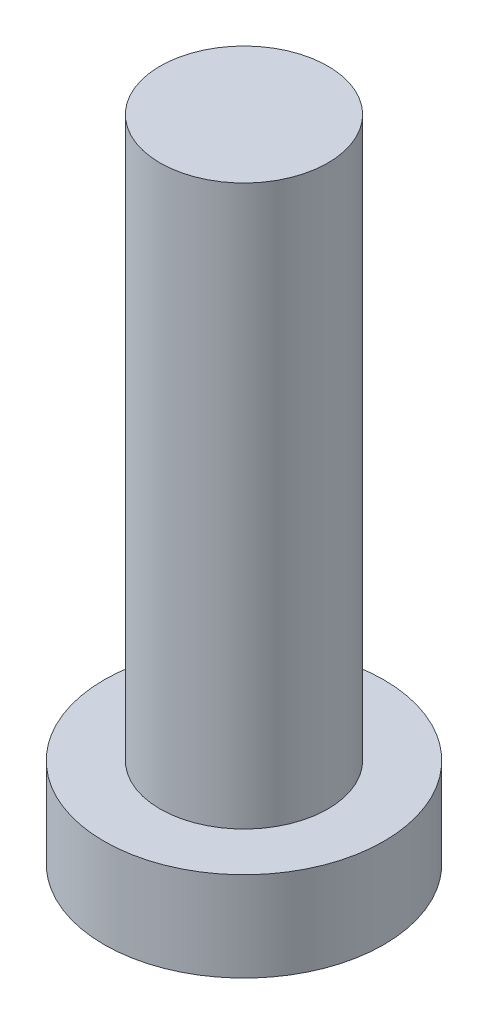
ISO-10303-21;
HEADER;
FILE_DESCRIPTION(('STEP AP214'),'2;1');
FILE_NAME('part.step','',(''),(''),'','','');
FILE_SCHEMA(('AUTOMOTIVE_DESIGN { 1 0 10303 214 1 1 1 1 }'));
ENDSEC;
DATA;
#1=APPLICATION_CONTEXT('core data for automotive mechanical design processes');
#2=APPLICATION_PROTOCOL_DEFINITION('international standard','automotive_design',2000,#1);
#3=PRODUCT_CONTEXT('',#1,'mechanical');
#4=PRODUCT('Part','Part','',(#3));
#5=PRODUCT_RELATED_PRODUCT_CATEGORY('part','',(#4));
#6=PRODUCT_DEFINITION_FORMATION('','',#4);
#7=PRODUCT_DEFINITION_CONTEXT('part definition',#1,'design');
#8=PRODUCT_DEFINITION('design','',#6,#7);
#9=PRODUCT_DEFINITION_SHAPE('','',#8);
#10=(LENGTH_UNIT() NAMED_UNIT(*) SI_UNIT(.MILLI.,.METRE.));
#11=(NAMED_UNIT(*) PLANE_ANGLE_UNIT() SI_UNIT($,.RADIAN.));
#12=(NAMED_UNIT(*) SI_UNIT($,.STERADIAN.) SOLID_ANGLE_UNIT());
#13=UNCERTAINTY_MEASURE_WITH_UNIT(LENGTH_MEASURE(1.E-05),#10,'distance_accuracy_value','');
#14=(GEOMETRIC_REPRESENTATION_CONTEXT(3) GLOBAL_UNCERTAINTY_ASSIGNED_CONTEXT((#13)) GLOBAL_UNIT_ASSIGNED_CONTEXT((#10,
#11,#12)) REPRESENTATION_CONTEXT('',''));
#15=CARTESIAN_POINT('',(0.,0.,0.));
#16=DIRECTION('',(0.,0.,1.));
#17=DIRECTION('',(1.,0.,0.));
#18=AXIS2_PLACEMENT_3D('',#15,#16,#17);
#19=CARTESIAN_POINT('',(0.,0.,0.));
#20=DIRECTION('',(0.,1.,0.));
#21=DIRECTION('',(0.,0.,1.));
#22=AXIS2_PLACEMENT_3D('',#19,#20,#21);
#23=PLANE('',#22);
#24=CARTESIAN_POINT('',(0.,0.,0.));
#25=DIRECTION('',(0.,1.,0.));
#26=DIRECTION('',(0.,0.,1.));
#27=AXIS2_PLACEMENT_3D('',#24,#25,#26);
#28=CIRCLE('',#27,2.5);
#29=CARTESIAN_POINT('',(0.,0.,2.5));
#30=VERTEX_POINT('',#29);
#31=EDGE_CURVE('E39',#30,#30,#28,.T.);
#32=ORIENTED_EDGE('',*,*,#31,.F.);
#33=EDGE_LOOP('',(#32));
#34=FACE_BOUND('',#33,.T.);
#35=CARTESIAN_POINT('',(1.,0.,1.));
#36=DIRECTION('',(0.,1.,0.));
#37=DIRECTION('',(0.,0.,-1.));
#38=AXIS2_PLACEMENT_3D('',#35,#36,#37);
#39=CIRCLE('',#38,0.5);
#40=CARTESIAN_POINT('',(1.,0.,0.5));
#41=VERTEX_POINT('',#40);
#42=CARTESIAN_POINT('',(0.5,0.,1.));
#43=VERTEX_POINT('',#42);
#44=EDGE_CURVE('E186',#41,#43,#39,.T.);
#45=ORIENTED_EDGE('',*,*,#44,.F.);
#46=DIRECTION('',(-1.,0.,0.));
#47=VECTOR('',#46,1.);
#48=CARTESIAN_POINT('',(1.,0.,0.5));
#49=LINE('',#48,#47);
#50=CARTESIAN_POINT('',(1.75,0.,0.5));
#51=VERTEX_POINT('',#50);
#52=EDGE_CURVE('E52',#51,#41,#49,.T.);
#53=ORIENTED_EDGE('',*,*,#52,.F.);
#54=DIRECTION('',(0.,0.,1.));
#55=VECTOR('',#54,1.);
#56=CARTESIAN_POINT('',(1.75,0.,-0.5));
#57=LINE('',#56,#55);
#58=CARTESIAN_POINT('',(1.75,0.,-0.5));
#59=VERTEX_POINT('',#58);
#60=EDGE_CURVE('E225',#59,#51,#57,.T.);
#61=ORIENTED_EDGE('',*,*,#60,.F.);
#62=DIRECTION('',(1.,0.,0.));
#63=VECTOR('',#62,1.);
#64=CARTESIAN_POINT('',(1.,0.,-0.5));
#65=LINE('',#64,#63);
#66=CARTESIAN_POINT('',(1.,0.,-0.5));
#67=VERTEX_POINT('',#66);
#68=EDGE_CURVE('E223',#67,#59,#65,.T.);
#69=ORIENTED_EDGE('',*,*,#68,.F.);
#70=CARTESIAN_POINT('',(1.,0.,-1.));
#71=DIRECTION('',(0.,1.,0.));
#72=DIRECTION('',(0.,0.,-1.));
#73=AXIS2_PLACEMENT_3D('',#70,#71,#72);
#74=CIRCLE('',#73,0.5);
#75=CARTESIAN_POINT('',(0.5,0.,-1.));
#76=VERTEX_POINT('',#75);
#77=EDGE_CURVE('E160',#76,#67,#74,.T.);
#78=ORIENTED_EDGE('',*,*,#77,.F.);
#79=DIRECTION('',(0.,0.,1.));
#80=VECTOR('',#79,1.);
#81=CARTESIAN_POINT('',(0.5,0.,-1.75));
#82=LINE('',#81,#80);
#83=CARTESIAN_POINT('',(0.5,0.,-1.75));
#84=VERTEX_POINT('',#83);
#85=EDGE_CURVE('E219',#84,#76,#82,.T.);
#86=ORIENTED_EDGE('',*,*,#85,.F.);
#87=DIRECTION('',(1.,0.,0.));
#88=VECTOR('',#87,1.);
#89=CARTESIAN_POINT('',(-0.5,0.,-1.75));
#90=LINE('',#89,#88);
#91=CARTESIAN_POINT('',(-0.5,0.,-1.75));
#92=VERTEX_POINT('',#91);
#93=EDGE_CURVE('E216',#92,#84,#90,.T.);
#94=ORIENTED_EDGE('',*,*,#93,.F.);
#95=DIRECTION('',(0.,0.,-1.));
#96=VECTOR('',#95,1.);
#97=CARTESIAN_POINT('',(-0.5,0.,-1.75));
#98=LINE('',#97,#96);
#99=CARTESIAN_POINT('',(-0.5,0.,-1.));
#100=VERTEX_POINT('',#99);
#101=EDGE_CURVE('E213',#100,#92,#98,.T.);
#102=ORIENTED_EDGE('',*,*,#101,.F.);
#103=CARTESIAN_POINT('',(-1.,0.,-1.));
#104=DIRECTION('',(0.,1.,0.));
#105=DIRECTION('',(0.,0.,-1.));
#106=AXIS2_PLACEMENT_3D('',#103,#104,#105);
#107=CIRCLE('',#106,0.5);
#108=CARTESIAN_POINT('',(-1.,0.,-0.5));
#109=VERTEX_POINT('',#108);
#110=EDGE_CURVE('E210',#109,#100,#107,.T.);
#111=ORIENTED_EDGE('',*,*,#110,.F.);
#112=DIRECTION('',(1.,0.,0.));
#113=VECTOR('',#112,1.);
#114=CARTESIAN_POINT('',(-1.75,0.,-0.5));
#115=LINE('',#114,#113);
#116=CARTESIAN_POINT('',(-1.75,0.,-0.5));
#117=VERTEX_POINT('',#116);
#118=EDGE_CURVE('E207',#117,#109,#115,.T.);
#119=ORIENTED_EDGE('',*,*,#118,.F.);
#120=DIRECTION('',(0.,0.,-1.));
#121=VECTOR('',#120,1.);
#122=CARTESIAN_POINT('',(-1.75,0.,-0.5));
#123=LINE('',#122,#121);
#124=CARTESIAN_POINT('',(-1.75,0.,0.5));
#125=VERTEX_POINT('',#124);
#126=EDGE_CURVE('E204',#125,#117,#123,.T.);
#127=ORIENTED_EDGE('',*,*,#126,.F.);
#128=DIRECTION('',(-1.,0.,0.));
#129=VECTOR('',#128,1.);
#130=CARTESIAN_POINT('',(-1.75,0.,0.5));
#131=LINE('',#130,#129);
#132=CARTESIAN_POINT('',(-1.,0.,0.5));
#133=VERTEX_POINT('',#132);
#134=EDGE_CURVE('E201',#133,#125,#131,.T.);
#135=ORIENTED_EDGE('',*,*,#134,.F.);
#136=CARTESIAN_POINT('',(-1.,0.,1.));
#137=DIRECTION('',(0.,1.,0.));
#138=DIRECTION('',(0.,0.,1.));
#139=AXIS2_PLACEMENT_3D('',#136,#137,#138);
#140=CIRCLE('',#139,0.5);
#141=CARTESIAN_POINT('',(-0.5,0.,1.));
#142=VERTEX_POINT('',#141);
#143=EDGE_CURVE('E198',#142,#133,#140,.T.);
#144=ORIENTED_EDGE('',*,*,#143,.F.);
#145=DIRECTION('',(0.,0.,-1.));
#146=VECTOR('',#145,1.);
#147=CARTESIAN_POINT('',(-0.5,0.,1.));
#148=LINE('',#147,#146);
#149=CARTESIAN_POINT('',(-0.5,0.,1.75));
#150=VERTEX_POINT('',#149);
#151=EDGE_CURVE('E195',#150,#142,#148,.T.);
#152=ORIENTED_EDGE('',*,*,#151,.F.);
#153=DIRECTION('',(-1.,0.,0.));
#154=VECTOR('',#153,1.);
#155=CARTESIAN_POINT('',(-0.5,0.,1.75));
#156=LINE('',#155,#154);
#157=CARTESIAN_POINT('',(0.5,0.,1.75));
#158=VERTEX_POINT('',#157);
#159=EDGE_CURVE('E192',#158,#150,#156,.T.);
#160=ORIENTED_EDGE('',*,*,#159,.F.);
#161=DIRECTION('',(0.,0.,1.));
#162=VECTOR('',#161,1.);
#163=CARTESIAN_POINT('',(0.5,0.,1.));
#164=LINE('',#163,#162);
#165=EDGE_CURVE('E189',#43,#158,#164,.T.);
#166=ORIENTED_EDGE('',*,*,#165,.F.);
#167=EDGE_LOOP('',(#45,#53,#61,#69,#78,#86,#94,#102,#111,#119,#127,#135,#144,#152,#160,#166));
#168=FACE_BOUND('',#167,.T.);
#169=ADVANCED_FACE('F35',(#34,#168),#23,.F.);
#170=CARTESIAN_POINT('',(0.,1.6,0.));
#171=DIRECTION('',(0.,-1.,0.));
#172=DIRECTION('',(0.,0.,-1.));
#173=AXIS2_PLACEMENT_3D('',#170,#171,#172);
#174=CYLINDRICAL_SURFACE('',#173,2.5);
#175=CARTESIAN_POINT('',(0.,1.6,0.));
#176=DIRECTION('',(0.,1.,0.));
#177=DIRECTION('',(0.,0.,1.));
#178=AXIS2_PLACEMENT_3D('',#175,#176,#177);
#179=CIRCLE('',#178,2.5);
#180=CARTESIAN_POINT('',(0.,1.6,2.5));
#181=VERTEX_POINT('',#180);
#182=EDGE_CURVE('E44',#181,#181,#179,.T.);
#183=ORIENTED_EDGE('',*,*,#182,.F.);
#184=EDGE_LOOP('',(#183));
#185=FACE_BOUND('',#184,.T.);
#186=ORIENTED_EDGE('',*,*,#31,.T.);
#187=EDGE_LOOP('',(#186));
#188=FACE_BOUND('',#187,.T.);
#189=ADVANCED_FACE('F37',(#185,#188),#174,.T.);
#190=CARTESIAN_POINT('',(0.,1.6,0.));
#191=DIRECTION('',(0.,1.,0.));
#192=DIRECTION('',(0.,0.,1.));
#193=AXIS2_PLACEMENT_3D('',#190,#191,#192);
#194=PLANE('',#193);
#195=CARTESIAN_POINT('',(0.,1.6,0.));
#196=DIRECTION('',(0.,1.,0.));
#197=DIRECTION('',(0.,0.,1.));
#198=AXIS2_PLACEMENT_3D('',#195,#196,#197);
#199=CIRCLE('',#198,1.5);
#200=CARTESIAN_POINT('',(0.,1.6,1.5));
#201=VERTEX_POINT('',#200);
#202=EDGE_CURVE('E11',#201,#201,#199,.T.);
#203=ORIENTED_EDGE('',*,*,#202,.F.);
#204=EDGE_LOOP('',(#203));
#205=FACE_BOUND('',#204,.T.);
#206=ORIENTED_EDGE('',*,*,#182,.T.);
#207=EDGE_LOOP('',(#206));
#208=FACE_BOUND('',#207,.T.);
#209=ADVANCED_FACE('F374',(#205,#208),#194,.T.);
#210=CARTESIAN_POINT('',(0.,11.6,0.));
#211=DIRECTION('',(0.,-1.,0.));
#212=DIRECTION('',(0.,0.,-1.));
#213=AXIS2_PLACEMENT_3D('',#210,#211,#212);
#214=CYLINDRICAL_SURFACE('',#213,1.5);
#215=CARTESIAN_POINT('',(0.,11.6,0.));
#216=DIRECTION('',(0.,1.,0.));
#217=DIRECTION('',(0.,0.,1.));
#218=AXIS2_PLACEMENT_3D('',#215,#216,#217);
#219=CIRCLE('',#218,1.5);
#220=CARTESIAN_POINT('',(0.,11.6,1.5));
#221=VERTEX_POINT('',#220);
#222=EDGE_CURVE('E229',#221,#221,#219,.T.);
#223=ORIENTED_EDGE('',*,*,#222,.F.);
#224=EDGE_LOOP('',(#223));
#225=FACE_BOUND('',#224,.T.);
#226=ORIENTED_EDGE('',*,*,#202,.T.);
#227=EDGE_LOOP('',(#226));
#228=FACE_BOUND('',#227,.T.);
#229=ADVANCED_FACE('F370',(#225,#228),#214,.T.);
#230=CARTESIAN_POINT('',(0.,11.6,0.));
#231=DIRECTION('',(0.,1.,0.));
#232=DIRECTION('',(0.,0.,1.));
#233=AXIS2_PLACEMENT_3D('',#230,#231,#232);
#234=PLANE('',#233);
#235=ORIENTED_EDGE('',*,*,#222,.T.);
#236=EDGE_LOOP('',(#235));
#237=FACE_BOUND('',#236,.T.);
#238=ADVANCED_FACE('F320',(#237),#234,.T.);
#239=CARTESIAN_POINT('',(1.,1.,0.5));
#240=DIRECTION('',(0.,0.,1.));
#241=DIRECTION('',(1.,0.,0.));
#242=AXIS2_PLACEMENT_3D('',#239,#240,#241);
#243=PLANE('',#242);
#244=ORIENTED_EDGE('',*,*,#52,.T.);
#245=DIRECTION('',(0.,-1.,0.));
#246=VECTOR('',#245,1.);
#247=CARTESIAN_POINT('',(1.,1.,0.5));
#248=LINE('',#247,#246);
#249=CARTESIAN_POINT('',(1.,1.,0.5));
#250=VERTEX_POINT('',#249);
#251=EDGE_CURVE('E112',#250,#41,#248,.T.);
#252=ORIENTED_EDGE('',*,*,#251,.F.);
#253=DIRECTION('',(-1.,0.,0.));
#254=VECTOR('',#253,1.);
#255=CARTESIAN_POINT('',(1.,1.,0.5));
#256=LINE('',#255,#254);
#257=CARTESIAN_POINT('',(1.75,1.,0.5));
#258=VERTEX_POINT('',#257);
#259=EDGE_CURVE('E227',#258,#250,#256,.T.);
#260=ORIENTED_EDGE('',*,*,#259,.F.);
#261=DIRECTION('',(0.,-1.,0.));
#262=VECTOR('',#261,1.);
#263=CARTESIAN_POINT('',(1.75,1.,0.5));
#264=LINE('',#263,#262);
#265=EDGE_CURVE('E60',#258,#51,#264,.T.);
#266=ORIENTED_EDGE('',*,*,#265,.T.);
#267=EDGE_LOOP('',(#244,#252,#260,#266));
#268=FACE_BOUND('',#267,.T.);
#269=ADVANCED_FACE('F313',(#268),#243,.F.);
#270=CARTESIAN_POINT('',(1.75,1.,-0.5));
#271=DIRECTION('',(1.,0.,0.));
#272=DIRECTION('',(0.,0.,-1.));
#273=AXIS2_PLACEMENT_3D('',#270,#271,#272);
#274=PLANE('',#273);
#275=ORIENTED_EDGE('',*,*,#60,.T.);
#276=ORIENTED_EDGE('',*,*,#265,.F.);
#277=DIRECTION('',(0.,0.,1.));
#278=VECTOR('',#277,1.);
#279=CARTESIAN_POINT('',(1.75,1.,-0.5));
#280=LINE('',#279,#278);
#281=CARTESIAN_POINT('',(1.75,1.,-0.5));
#282=VERTEX_POINT('',#281);
#283=EDGE_CURVE('E172',#282,#258,#280,.T.);
#284=ORIENTED_EDGE('',*,*,#283,.F.);
#285=DIRECTION('',(0.,-1.,0.));
#286=VECTOR('',#285,1.);
#287=CARTESIAN_POINT('',(1.75,1.,-0.5));
#288=LINE('',#287,#286);
#289=EDGE_CURVE('E164',#282,#59,#288,.T.);
#290=ORIENTED_EDGE('',*,*,#289,.T.);
#291=EDGE_LOOP('',(#275,#276,#284,#290));
#292=FACE_BOUND('',#291,.T.);
#293=ADVANCED_FACE('F311',(#292),#274,.F.);
#294=CARTESIAN_POINT('',(1.,1.,-0.5));
#295=DIRECTION('',(0.,0.,-1.));
#296=DIRECTION('',(-1.,0.,0.));
#297=AXIS2_PLACEMENT_3D('',#294,#295,#296);
#298=PLANE('',#297);
#299=ORIENTED_EDGE('',*,*,#68,.T.);
#300=ORIENTED_EDGE('',*,*,#289,.F.);
#301=DIRECTION('',(1.,0.,0.));
#302=VECTOR('',#301,1.);
#303=CARTESIAN_POINT('',(1.,1.,-0.5));
#304=LINE('',#303,#302);
#305=CARTESIAN_POINT('',(1.,1.,-0.5));
#306=VERTEX_POINT('',#305);
#307=EDGE_CURVE('E168',#306,#282,#304,.T.);
#308=ORIENTED_EDGE('',*,*,#307,.F.);
#309=DIRECTION('',(0.,-1.,0.));
#310=VECTOR('',#309,1.);
#311=CARTESIAN_POINT('',(1.,1.,-0.5));
#312=LINE('',#311,#310);
#313=EDGE_CURVE('E153',#306,#67,#312,.T.);
#314=ORIENTED_EDGE('',*,*,#313,.T.);
#315=EDGE_LOOP('',(#299,#300,#308,#314));
#316=FACE_BOUND('',#315,.T.);
#317=ADVANCED_FACE('F169',(#316),#298,.F.);
#318=CARTESIAN_POINT('',(1.,1.,-1.));
#319=DIRECTION('',(0.,-1.,0.));
#320=DIRECTION('',(0.,0.,-1.));
#321=AXIS2_PLACEMENT_3D('',#318,#319,#320);
#322=CYLINDRICAL_SURFACE('',#321,0.5);
#323=ORIENTED_EDGE('',*,*,#77,.T.);
#324=ORIENTED_EDGE('',*,*,#313,.F.);
#325=CARTESIAN_POINT('',(1.,1.,-1.));
#326=DIRECTION('',(0.,1.,0.));
#327=DIRECTION('',(0.,0.,-1.));
#328=AXIS2_PLACEMENT_3D('',#325,#326,#327);
#329=CIRCLE('',#328,0.5);
#330=CARTESIAN_POINT('',(0.5,1.,-1.));
#331=VERTEX_POINT('',#330);
#332=EDGE_CURVE('E157',#331,#306,#329,.T.);
#333=ORIENTED_EDGE('',*,*,#332,.F.);
#334=DIRECTION('',(0.,-1.,0.));
#335=VECTOR('',#334,1.);
#336=CARTESIAN_POINT('',(0.5,1.,-1.));
#337=LINE('',#336,#335);
#338=EDGE_CURVE('E165',#331,#76,#337,.T.);
#339=ORIENTED_EDGE('',*,*,#338,.T.);
#340=EDGE_LOOP('',(#323,#324,#333,#339));
#341=FACE_BOUND('',#340,.T.);
#342=ADVANCED_FACE('F155',(#341),#322,.T.);
#343=CARTESIAN_POINT('',(0.5,1.,-1.75));
#344=DIRECTION('',(1.,0.,0.));
#345=DIRECTION('',(0.,0.,-1.));
#346=AXIS2_PLACEMENT_3D('',#343,#344,#345);
#347=PLANE('',#346);
#348=ORIENTED_EDGE('',*,*,#85,.T.);
#349=ORIENTED_EDGE('',*,*,#338,.F.);
#350=DIRECTION('',(0.,0.,1.));
#351=VECTOR('',#350,1.);
#352=CARTESIAN_POINT('',(0.5,1.,-1.75));
#353=LINE('',#352,#351);
#354=CARTESIAN_POINT('',(0.5,1.,-1.75));
#355=VERTEX_POINT('',#354);
#356=EDGE_CURVE('E178',#355,#331,#353,.T.);
#357=ORIENTED_EDGE('',*,*,#356,.F.);
#358=DIRECTION('',(0.,-1.,0.));
#359=VECTOR('',#358,1.);
#360=CARTESIAN_POINT('',(0.5,1.,-1.75));
#361=LINE('',#360,#359);
#362=EDGE_CURVE('E232',#355,#84,#361,.T.);
#363=ORIENTED_EDGE('',*,*,#362,.T.);
#364=EDGE_LOOP('',(#348,#349,#357,#363));
#365=FACE_BOUND('',#364,.T.);
#366=ADVANCED_FACE('F310',(#365),#347,.F.);
#367=CARTESIAN_POINT('',(-0.5,1.,-1.75));
#368=DIRECTION('',(0.,0.,-1.));
#369=DIRECTION('',(-1.,0.,0.));
#370=AXIS2_PLACEMENT_3D('',#367,#368,#369);
#371=PLANE('',#370);
#372=ORIENTED_EDGE('',*,*,#93,.T.);
#373=ORIENTED_EDGE('',*,*,#362,.F.);
#374=DIRECTION('',(1.,0.,0.));
#375=VECTOR('',#374,1.);
#376=CARTESIAN_POINT('',(-0.5,1.,-1.75));
#377=LINE('',#376,#375);
#378=CARTESIAN_POINT('',(-0.5,1.,-1.75));
#379=VERTEX_POINT('',#378);
#380=EDGE_CURVE('E180',#379,#355,#377,.T.);
#381=ORIENTED_EDGE('',*,*,#380,.F.);
#382=DIRECTION('',(0.,-1.,0.));
#383=VECTOR('',#382,1.);
#384=CARTESIAN_POINT('',(-0.5,1.,-1.75));
#385=LINE('',#384,#383);
#386=EDGE_CURVE('E234',#379,#92,#385,.T.);
#387=ORIENTED_EDGE('',*,*,#386,.T.);
#388=EDGE_LOOP('',(#372,#373,#381,#387));
#389=FACE_BOUND('',#388,.T.);
#390=ADVANCED_FACE('F306',(#389),#371,.F.);
#391=CARTESIAN_POINT('',(-0.5,1.,-1.75));
#392=DIRECTION('',(-1.,0.,0.));
#393=DIRECTION('',(0.,0.,1.));
#394=AXIS2_PLACEMENT_3D('',#391,#392,#393);
#395=PLANE('',#394);
#396=ORIENTED_EDGE('',*,*,#101,.T.);
#397=ORIENTED_EDGE('',*,*,#386,.F.);
#398=DIRECTION('',(0.,0.,-1.));
#399=VECTOR('',#398,1.);
#400=CARTESIAN_POINT('',(-0.5,1.,-1.75));
#401=LINE('',#400,#399);
#402=CARTESIAN_POINT('',(-0.5,1.,-1.));
#403=VERTEX_POINT('',#402);
#404=EDGE_CURVE('E301',#403,#379,#401,.T.);
#405=ORIENTED_EDGE('',*,*,#404,.F.);
#406=DIRECTION('',(0.,-1.,0.));
#407=VECTOR('',#406,1.);
#408=CARTESIAN_POINT('',(-0.5,1.,-1.));
#409=LINE('',#408,#407);
#410=EDGE_CURVE('E236',#403,#100,#409,.T.);
#411=ORIENTED_EDGE('',*,*,#410,.T.);
#412=EDGE_LOOP('',(#396,#397,#405,#411));
#413=FACE_BOUND('',#412,.T.);
#414=ADVANCED_FACE('F330',(#413),#395,.F.);
#415=CARTESIAN_POINT('',(-1.,1.,-1.));
#416=DIRECTION('',(0.,-1.,0.));
#417=DIRECTION('',(0.,0.,-1.));
#418=AXIS2_PLACEMENT_3D('',#415,#416,#417);
#419=CYLINDRICAL_SURFACE('',#418,0.5);
#420=ORIENTED_EDGE('',*,*,#110,.T.);
#421=ORIENTED_EDGE('',*,*,#410,.F.);
#422=CARTESIAN_POINT('',(-1.,1.,-1.));
#423=DIRECTION('',(0.,1.,0.));
#424=DIRECTION('',(0.,0.,-1.));
#425=AXIS2_PLACEMENT_3D('',#422,#423,#424);
#426=CIRCLE('',#425,0.5);
#427=CARTESIAN_POINT('',(-1.,1.,-0.5));
#428=VERTEX_POINT('',#427);
#429=EDGE_CURVE('E298',#428,#403,#426,.T.);
#430=ORIENTED_EDGE('',*,*,#429,.F.);
#431=DIRECTION('',(0.,-1.,0.));
#432=VECTOR('',#431,1.);
#433=CARTESIAN_POINT('',(-1.,1.,-0.5));
#434=LINE('',#433,#432);
#435=EDGE_CURVE('E238',#428,#109,#434,.T.);
#436=ORIENTED_EDGE('',*,*,#435,.T.);
#437=EDGE_LOOP('',(#420,#421,#430,#436));
#438=FACE_BOUND('',#437,.T.);
#439=ADVANCED_FACE('F333',(#438),#419,.T.);
#440=CARTESIAN_POINT('',(-1.75,1.,-0.5));
#441=DIRECTION('',(0.,0.,-1.));
#442=DIRECTION('',(-1.,0.,0.));
#443=AXIS2_PLACEMENT_3D('',#440,#441,#442);
#444=PLANE('',#443);
#445=ORIENTED_EDGE('',*,*,#118,.T.);
#446=ORIENTED_EDGE('',*,*,#435,.F.);
#447=DIRECTION('',(1.,0.,0.));
#448=VECTOR('',#447,1.);
#449=CARTESIAN_POINT('',(-1.75,1.,-0.5));
#450=LINE('',#449,#448);
#451=CARTESIAN_POINT('',(-1.75,1.,-0.5));
#452=VERTEX_POINT('',#451);
#453=EDGE_CURVE('E295',#452,#428,#450,.T.);
#454=ORIENTED_EDGE('',*,*,#453,.F.);
#455=DIRECTION('',(0.,-1.,0.));
#456=VECTOR('',#455,1.);
#457=CARTESIAN_POINT('',(-1.75,1.,-0.5));
#458=LINE('',#457,#456);
#459=EDGE_CURVE('E240',#452,#117,#458,.T.);
#460=ORIENTED_EDGE('',*,*,#459,.T.);
#461=EDGE_LOOP('',(#445,#446,#454,#460));
#462=FACE_BOUND('',#461,.T.);
#463=ADVANCED_FACE('F337',(#462),#444,.F.);
#464=CARTESIAN_POINT('',(-1.75,1.,-0.5));
#465=DIRECTION('',(-1.,0.,0.));
#466=DIRECTION('',(0.,0.,1.));
#467=AXIS2_PLACEMENT_3D('',#464,#465,#466);
#468=PLANE('',#467);
#469=ORIENTED_EDGE('',*,*,#126,.T.);
#470=ORIENTED_EDGE('',*,*,#459,.F.);
#471=DIRECTION('',(0.,0.,-1.));
#472=VECTOR('',#471,1.);
#473=CARTESIAN_POINT('',(-1.75,1.,-0.5));
#474=LINE('',#473,#472);
#475=CARTESIAN_POINT('',(-1.75,1.,0.5));
#476=VERTEX_POINT('',#475);
#477=EDGE_CURVE('E292',#476,#452,#474,.T.);
#478=ORIENTED_EDGE('',*,*,#477,.F.);
#479=DIRECTION('',(0.,-1.,0.));
#480=VECTOR('',#479,1.);
#481=CARTESIAN_POINT('',(-1.75,1.,0.5));
#482=LINE('',#481,#480);
#483=EDGE_CURVE('E242',#476,#125,#482,.T.);
#484=ORIENTED_EDGE('',*,*,#483,.T.);
#485=EDGE_LOOP('',(#469,#470,#478,#484));
#486=FACE_BOUND('',#485,.T.);
#487=ADVANCED_FACE('F341',(#486),#468,.F.);
#488=CARTESIAN_POINT('',(-1.75,1.,0.5));
#489=DIRECTION('',(0.,0.,1.));
#490=DIRECTION('',(1.,0.,0.));
#491=AXIS2_PLACEMENT_3D('',#488,#489,#490);
#492=PLANE('',#491);
#493=ORIENTED_EDGE('',*,*,#134,.T.);
#494=ORIENTED_EDGE('',*,*,#483,.F.);
#495=DIRECTION('',(-1.,0.,0.));
#496=VECTOR('',#495,1.);
#497=CARTESIAN_POINT('',(-1.75,1.,0.5));
#498=LINE('',#497,#496);
#499=CARTESIAN_POINT('',(-1.,1.,0.5));
#500=VERTEX_POINT('',#499);
#501=EDGE_CURVE('E289',#500,#476,#498,.T.);
#502=ORIENTED_EDGE('',*,*,#501,.F.);
#503=DIRECTION('',(0.,-1.,0.));
#504=VECTOR('',#503,1.);
#505=CARTESIAN_POINT('',(-1.,1.,0.5));
#506=LINE('',#505,#504);
#507=EDGE_CURVE('E244',#500,#133,#506,.T.);
#508=ORIENTED_EDGE('',*,*,#507,.T.);
#509=EDGE_LOOP('',(#493,#494,#502,#508));
#510=FACE_BOUND('',#509,.T.);
#511=ADVANCED_FACE('F345',(#510),#492,.F.);
#512=CARTESIAN_POINT('',(-1.,1.,1.));
#513=DIRECTION('',(0.,-1.,0.));
#514=DIRECTION('',(0.,0.,-1.));
#515=AXIS2_PLACEMENT_3D('',#512,#513,#514);
#516=CYLINDRICAL_SURFACE('',#515,0.5);
#517=ORIENTED_EDGE('',*,*,#143,.T.);
#518=ORIENTED_EDGE('',*,*,#507,.F.);
#519=CARTESIAN_POINT('',(-1.,1.,1.));
#520=DIRECTION('',(0.,1.,0.));
#521=DIRECTION('',(0.,0.,1.));
#522=AXIS2_PLACEMENT_3D('',#519,#520,#521);
#523=CIRCLE('',#522,0.5);
#524=CARTESIAN_POINT('',(-0.5,1.,1.));
#525=VERTEX_POINT('',#524);
#526=EDGE_CURVE('E286',#525,#500,#523,.T.);
#527=ORIENTED_EDGE('',*,*,#526,.F.);
#528=DIRECTION('',(0.,-1.,0.));
#529=VECTOR('',#528,1.);
#530=CARTESIAN_POINT('',(-0.5,1.,1.));
#531=LINE('',#530,#529);
#532=EDGE_CURVE('E246',#525,#142,#531,.T.);
#533=ORIENTED_EDGE('',*,*,#532,.T.);
#534=EDGE_LOOP('',(#517,#518,#527,#533));
#535=FACE_BOUND('',#534,.T.);
#536=ADVANCED_FACE('F349',(#535),#516,.T.);
#537=CARTESIAN_POINT('',(-0.5,1.,1.));
#538=DIRECTION('',(-1.,0.,0.));
#539=DIRECTION('',(0.,0.,1.));
#540=AXIS2_PLACEMENT_3D('',#537,#538,#539);
#541=PLANE('',#540);
#542=ORIENTED_EDGE('',*,*,#151,.T.);
#543=ORIENTED_EDGE('',*,*,#532,.F.);
#544=DIRECTION('',(0.,0.,-1.));
#545=VECTOR('',#544,1.);
#546=CARTESIAN_POINT('',(-0.5,1.,1.));
#547=LINE('',#546,#545);
#548=CARTESIAN_POINT('',(-0.5,1.,1.75));
#549=VERTEX_POINT('',#548);
#550=EDGE_CURVE('E283',#549,#525,#547,.T.);
#551=ORIENTED_EDGE('',*,*,#550,.F.);
#552=DIRECTION('',(0.,-1.,0.));
#553=VECTOR('',#552,1.);
#554=CARTESIAN_POINT('',(-0.5,1.,1.75));
#555=LINE('',#554,#553);
#556=EDGE_CURVE('E248',#549,#150,#555,.T.);
#557=ORIENTED_EDGE('',*,*,#556,.T.);
#558=EDGE_LOOP('',(#542,#543,#551,#557));
#559=FACE_BOUND('',#558,.T.);
#560=ADVANCED_FACE('F353',(#559),#541,.F.);
#561=CARTESIAN_POINT('',(-0.5,1.,1.75));
#562=DIRECTION('',(0.,0.,1.));
#563=DIRECTION('',(1.,0.,0.));
#564=AXIS2_PLACEMENT_3D('',#561,#562,#563);
#565=PLANE('',#564);
#566=ORIENTED_EDGE('',*,*,#159,.T.);
#567=ORIENTED_EDGE('',*,*,#556,.F.);
#568=DIRECTION('',(-1.,0.,0.));
#569=VECTOR('',#568,1.);
#570=CARTESIAN_POINT('',(-0.5,1.,1.75));
#571=LINE('',#570,#569);
#572=CARTESIAN_POINT('',(0.5,1.,1.75));
#573=VERTEX_POINT('',#572);
#574=EDGE_CURVE('E280',#573,#549,#571,.T.);
#575=ORIENTED_EDGE('',*,*,#574,.F.);
#576=DIRECTION('',(0.,-1.,0.));
#577=VECTOR('',#576,1.);
#578=CARTESIAN_POINT('',(0.5,1.,1.75));
#579=LINE('',#578,#577);
#580=EDGE_CURVE('E250',#573,#158,#579,.T.);
#581=ORIENTED_EDGE('',*,*,#580,.T.);
#582=EDGE_LOOP('',(#566,#567,#575,#581));
#583=FACE_BOUND('',#582,.T.);
#584=ADVANCED_FACE('F357',(#583),#565,.F.);
#585=CARTESIAN_POINT('',(0.5,1.,1.));
#586=DIRECTION('',(1.,0.,0.));
#587=DIRECTION('',(0.,0.,-1.));
#588=AXIS2_PLACEMENT_3D('',#585,#586,#587);
#589=PLANE('',#588);
#590=ORIENTED_EDGE('',*,*,#165,.T.);
#591=ORIENTED_EDGE('',*,*,#580,.F.);
#592=DIRECTION('',(0.,0.,1.));
#593=VECTOR('',#592,1.);
#594=CARTESIAN_POINT('',(0.5,1.,1.));
#595=LINE('',#594,#593);
#596=CARTESIAN_POINT('',(0.5,1.,1.));
#597=VERTEX_POINT('',#596);
#598=EDGE_CURVE('E275',#597,#573,#595,.T.);
#599=ORIENTED_EDGE('',*,*,#598,.F.);
#600=DIRECTION('',(0.,-1.,0.));
#601=VECTOR('',#600,1.);
#602=CARTESIAN_POINT('',(0.5,1.,1.));
#603=LINE('',#602,#601);
#604=EDGE_CURVE('E252',#597,#43,#603,.T.);
#605=ORIENTED_EDGE('',*,*,#604,.T.);
#606=EDGE_LOOP('',(#590,#591,#599,#605));
#607=FACE_BOUND('',#606,.T.);
#608=ADVANCED_FACE('F361',(#607),#589,.F.);
#609=CARTESIAN_POINT('',(1.,1.,1.));
#610=DIRECTION('',(0.,-1.,0.));
#611=DIRECTION('',(0.,0.,-1.));
#612=AXIS2_PLACEMENT_3D('',#609,#610,#611);
#613=CYLINDRICAL_SURFACE('',#612,0.5);
#614=ORIENTED_EDGE('',*,*,#44,.T.);
#615=ORIENTED_EDGE('',*,*,#604,.F.);
#616=CARTESIAN_POINT('',(1.,1.,1.));
#617=DIRECTION('',(0.,1.,0.));
#618=DIRECTION('',(0.,0.,-1.));
#619=AXIS2_PLACEMENT_3D('',#616,#617,#618);
#620=CIRCLE('',#619,0.5);
#621=EDGE_CURVE('E273',#250,#597,#620,.T.);
#622=ORIENTED_EDGE('',*,*,#621,.F.);
#623=ORIENTED_EDGE('',*,*,#251,.T.);
#624=EDGE_LOOP('',(#614,#615,#622,#623));
#625=FACE_BOUND('',#624,.T.);
#626=ADVANCED_FACE('F270',(#625),#613,.T.);
#627=CARTESIAN_POINT('',(1.,1.,-1.));
#628=DIRECTION('',(0.,-1.,0.));
#629=DIRECTION('',(0.,0.,-1.));
#630=AXIS2_PLACEMENT_3D('',#627,#628,#629);
#631=PLANE('',#630);
#632=ORIENTED_EDGE('',*,*,#259,.T.);
#633=ORIENTED_EDGE('',*,*,#621,.T.);
#634=ORIENTED_EDGE('',*,*,#598,.T.);
#635=ORIENTED_EDGE('',*,*,#574,.T.);
#636=ORIENTED_EDGE('',*,*,#550,.T.);
#637=ORIENTED_EDGE('',*,*,#526,.T.);
#638=ORIENTED_EDGE('',*,*,#501,.T.);
#639=ORIENTED_EDGE('',*,*,#477,.T.);
#640=ORIENTED_EDGE('',*,*,#453,.T.);
#641=ORIENTED_EDGE('',*,*,#429,.T.);
#642=ORIENTED_EDGE('',*,*,#404,.T.);
#643=ORIENTED_EDGE('',*,*,#380,.T.);
#644=ORIENTED_EDGE('',*,*,#356,.T.);
#645=ORIENTED_EDGE('',*,*,#332,.T.);
#646=ORIENTED_EDGE('',*,*,#307,.T.);
#647=ORIENTED_EDGE('',*,*,#283,.T.);
#648=EDGE_LOOP('',(#632,#633,#634,#635,#636,#637,#638,#639,#640,#641,#642,#643,#644,#645,#646,#647));
#649=FACE_BOUND('',#648,.T.);
#650=ADVANCED_FACE('F175',(#649),#631,.T.);
#651=CLOSED_SHELL('',(#169,#189,#209,#229,#238,#269,#293,#317,#342,#366,#390,#414,#439,#463,
#487,#511,#536,#560,#584,#608,#626,#650));
#652=MANIFOLD_SOLID_BREP('B2',#651);
#653=ADVANCED_BREP_SHAPE_REPRESENTATION('',(#18,#652),#14);
#654=SHAPE_DEFINITION_REPRESENTATION(#9,#653);
ENDSEC;
END-ISO-10303-21;
